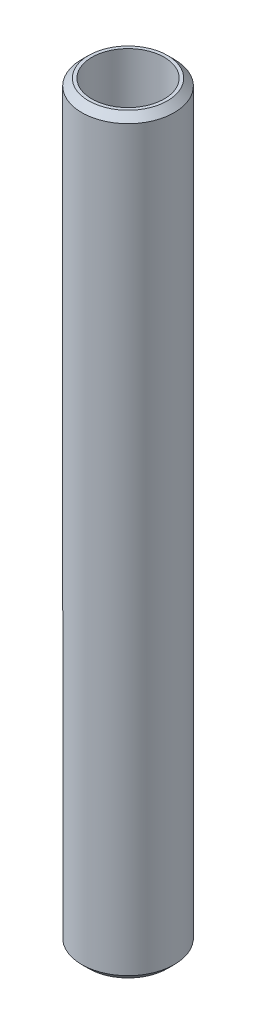
ISO-10303-21;
HEADER;
FILE_DESCRIPTION(('STEP AP214'),'2;1');
FILE_NAME('part.step','',(''),(''),'','','');
FILE_SCHEMA(('AUTOMOTIVE_DESIGN { 1 0 10303 214 1 1 1 1 }'));
ENDSEC;
DATA;
#1=APPLICATION_CONTEXT('core data for automotive mechanical design processes');
#2=APPLICATION_PROTOCOL_DEFINITION('international standard','automotive_design',2000,#1);
#3=PRODUCT_CONTEXT('',#1,'mechanical');
#4=PRODUCT('Part','Part','',(#3));
#5=PRODUCT_RELATED_PRODUCT_CATEGORY('part','',(#4));
#6=PRODUCT_DEFINITION_FORMATION('','',#4);
#7=PRODUCT_DEFINITION_CONTEXT('part definition',#1,'design');
#8=PRODUCT_DEFINITION('design','',#6,#7);
#9=PRODUCT_DEFINITION_SHAPE('','',#8);
#10=(LENGTH_UNIT() NAMED_UNIT(*) SI_UNIT(.MILLI.,.METRE.));
#11=(NAMED_UNIT(*) PLANE_ANGLE_UNIT() SI_UNIT($,.RADIAN.));
#12=(NAMED_UNIT(*) SI_UNIT($,.STERADIAN.) SOLID_ANGLE_UNIT());
#13=UNCERTAINTY_MEASURE_WITH_UNIT(LENGTH_MEASURE(1.E-05),#10,'distance_accuracy_value','');
#14=(GEOMETRIC_REPRESENTATION_CONTEXT(3) GLOBAL_UNCERTAINTY_ASSIGNED_CONTEXT((#13)) GLOBAL_UNIT_ASSIGNED_CONTEXT((#10,
#11,#12)) REPRESENTATION_CONTEXT('',''));
#15=CARTESIAN_POINT('',(0.,0.,0.));
#16=DIRECTION('',(0.,0.,1.));
#17=DIRECTION('',(1.,0.,0.));
#18=AXIS2_PLACEMENT_3D('',#15,#16,#17);
#19=CARTESIAN_POINT('',(0.,365.881459210702,0.));
#20=DIRECTION('',(0.,-1.,0.));
#21=DIRECTION('',(0.,0.,-1.));
#22=AXIS2_PLACEMENT_3D('',#19,#20,#21);
#23=CYLINDRICAL_SURFACE('',#22,22.5);
#24=CARTESIAN_POINT('',(0.,362.557926224536,0.));
#25=DIRECTION('',(0.,1.,0.));
#26=DIRECTION('',(0.,0.,1.));
#27=AXIS2_PLACEMENT_3D('',#24,#25,#26);
#28=CIRCLE('',#27,22.5);
#29=CARTESIAN_POINT('',(0.,362.557926224536,-22.5));
#30=VERTEX_POINT('',#29);
#31=EDGE_CURVE('E50',#30,#30,#28,.F.);
#32=CARTESIAN_POINT('',(0.,3.32353298616633,0.));
#33=DIRECTION('',(0.,1.,0.));
#34=DIRECTION('',(0.,0.,1.));
#35=AXIS2_PLACEMENT_3D('',#32,#33,#34);
#36=CIRCLE('',#35,22.5);
#37=CARTESIAN_POINT('',(0.,3.32353298616633,-22.5));
#38=VERTEX_POINT('',#37);
#39=EDGE_CURVE('E51',#38,#38,#36,.T.);
#40=CARTESIAN_POINT('',(0.,362.557926224536,-22.5));
#41=CARTESIAN_POINT('',(0.,358.81590129497,-22.5));
#42=CARTESIAN_POINT('',(0.,355.073876365403,-22.5));
#43=CARTESIAN_POINT('',(0.,347.589826506271,-22.5));
#44=CARTESIAN_POINT('',(0.,343.847801576704,-22.5));
#45=CARTESIAN_POINT('',(0.,336.363751717572,-22.5));
#46=CARTESIAN_POINT('',(0.,332.621726788005,-22.5));
#47=CARTESIAN_POINT('',(0.,325.137676928873,-22.5));
#48=CARTESIAN_POINT('',(0.,321.395651999306,-22.5));
#49=CARTESIAN_POINT('',(0.,313.911602140173,-22.5));
#50=CARTESIAN_POINT('',(0.,310.169577210607,-22.5));
#51=CARTESIAN_POINT('',(0.,302.685527351474,-22.5));
#52=CARTESIAN_POINT('',(0.,298.943502421908,-22.5));
#53=CARTESIAN_POINT('',(0.,291.459452562775,-22.5));
#54=CARTESIAN_POINT('',(0.,287.717427633209,-22.5));
#55=CARTESIAN_POINT('',(0.,280.233377774076,-22.5));
#56=CARTESIAN_POINT('',(0.,276.49135284451,-22.5));
#57=CARTESIAN_POINT('',(0.,269.007302985377,-22.5));
#58=CARTESIAN_POINT('',(0.,265.265278055811,-22.5));
#59=CARTESIAN_POINT('',(0.,257.781228196678,-22.5));
#60=CARTESIAN_POINT('',(0.,254.039203267112,-22.5));
#61=CARTESIAN_POINT('',(0.,246.555153407979,-22.5));
#62=CARTESIAN_POINT('',(0.,242.813128478413,-22.5));
#63=CARTESIAN_POINT('',(0.,235.32907861928,-22.5));
#64=CARTESIAN_POINT('',(0.,231.587053689714,-22.5));
#65=CARTESIAN_POINT('',(0.,224.103003830581,-22.5));
#66=CARTESIAN_POINT('',(0.,220.360978901015,-22.5));
#67=CARTESIAN_POINT('',(0.,212.876929041882,-22.5));
#68=CARTESIAN_POINT('',(0.,209.134904112316,-22.5));
#69=CARTESIAN_POINT('',(0.,201.650854253183,-22.5));
#70=CARTESIAN_POINT('',(0.,197.908829323617,-22.5));
#71=CARTESIAN_POINT('',(0.,190.424779464484,-22.5));
#72=CARTESIAN_POINT('',(0.,186.682754534918,-22.5));
#73=CARTESIAN_POINT('',(0.,179.198704675785,-22.5));
#74=CARTESIAN_POINT('',(0.,175.456679746218,-22.5));
#75=CARTESIAN_POINT('',(0.,167.972629887086,-22.5));
#76=CARTESIAN_POINT('',(0.,164.230604957519,-22.5));
#77=CARTESIAN_POINT('',(0.,156.746555098387,-22.5));
#78=CARTESIAN_POINT('',(0.,153.00453016882,-22.5));
#79=CARTESIAN_POINT('',(0.,145.520480309688,-22.5));
#80=CARTESIAN_POINT('',(0.,141.778455380121,-22.5));
#81=CARTESIAN_POINT('',(0.,134.294405520989,-22.5));
#82=CARTESIAN_POINT('',(0.,130.552380591422,-22.5));
#83=CARTESIAN_POINT('',(0.,123.06833073229,-22.5));
#84=CARTESIAN_POINT('',(0.,119.326305802723,-22.5));
#85=CARTESIAN_POINT('',(0.,111.842255943591,-22.5));
#86=CARTESIAN_POINT('',(0.,108.100231014024,-22.5));
#87=CARTESIAN_POINT('',(0.,100.616181154891,-22.5));
#88=CARTESIAN_POINT('',(0.,96.8741562253251,-22.5));
#89=CARTESIAN_POINT('',(0.,89.3901063661924,-22.5));
#90=CARTESIAN_POINT('',(0.,85.648081436626,-22.5));
#91=CARTESIAN_POINT('',(0.,78.1640315774933,-22.5));
#92=CARTESIAN_POINT('',(0.,74.422006647927,-22.5));
#93=CARTESIAN_POINT('',(0.,66.9379567887943,-22.5));
#94=CARTESIAN_POINT('',(0.,63.195931859228,-22.5));
#95=CARTESIAN_POINT('',(0.,55.7118820000953,-22.5));
#96=CARTESIAN_POINT('',(0.,51.9698570705289,-22.5));
#97=CARTESIAN_POINT('',(0.,44.4858072113962,-22.5));
#98=CARTESIAN_POINT('',(0.,40.7437822818298,-22.5));
#99=CARTESIAN_POINT('',(0.,33.2597324226971,-22.5));
#100=CARTESIAN_POINT('',(0.,29.5177074931308,-22.5));
#101=CARTESIAN_POINT('',(0.,22.0336576339981,-22.5));
#102=CARTESIAN_POINT('',(0.,18.2916327044318,-22.5));
#103=CARTESIAN_POINT('',(0.,10.8075828452991,-22.5));
#104=CARTESIAN_POINT('',(0.,7.06555791573269,-22.5));
#105=CARTESIAN_POINT('',(0.,3.32353298616633,-22.5));
#106=B_SPLINE_CURVE_WITH_KNOTS('',3,(#40,#41,#42,#43,#44,#45,#46,#47,#48,#49,#50,#51,#52,#53,
#54,#55,#56,#57,#58,#59,#60,#61,#62,#63,#64,#65,#66,#67,#68,#69,#70,#71,#72,#73,#74,#75,#76,#77,
#78,#79,#80,#81,#82,#83,#84,#85,#86,#87,#88,#89,#90,#91,#92,#93,#94,#95,#96,#97,#98,#99,#100,
#101,#102,#103,#104,#105),.UNSPECIFIED.,.F.,.F.,(4,2,2,2,2,2,2,2,2,2,2,2,2,2,2,2,2,2,2,2,2,2,2,
2,2,2,2,2,2,2,2,2,4),(0.,11.2260747886991,22.4521495773981,33.6782243660972,44.9042991547962,
56.1303739434953,67.3564487321943,78.5825235208934,89.8085983095924,101.034673098292,
112.260747886991,123.48682267569,134.712897464389,145.938972253088,157.165047041787,
168.391121830486,179.617196619185,190.843271407884,202.069346196583,213.295420985282,
224.521495773981,235.74757056268,246.973645351379,258.199720140078,269.425794928777,
280.651869717476,291.877944506175,303.104019294874,314.330094083573,325.556168872273,
336.782243660972,348.008318449671,359.23439323837),.UNSPECIFIED.);
#107=EDGE_CURVE('BSEAM39',#30,#38,#106,.T.);
#108=ORIENTED_EDGE('',*,*,#31,.T.);
#109=ORIENTED_EDGE('',*,*,#39,.T.);
#110=ORIENTED_EDGE('',*,*,#107,.T.);
#111=ORIENTED_EDGE('',*,*,#107,.F.);
#112=EDGE_LOOP('',(#108,#110,#109,#111));
#113=FACE_BOUND('',#112,.T.);
#114=ADVANCED_FACE('F39',(#113),#23,.T.);
#115=CARTESIAN_POINT('',(0.,365.881459210702,0.));
#116=DIRECTION('',(0.,1.,0.));
#117=DIRECTION('',(0.,0.,1.));
#118=AXIS2_PLACEMENT_3D('',#115,#116,#117);
#119=PLANE('',#118);
#120=CARTESIAN_POINT('',(0.,365.881459210702,0.));
#121=DIRECTION('',(0.,1.,0.));
#122=DIRECTION('',(0.,0.,1.));
#123=AXIS2_PLACEMENT_3D('',#120,#121,#122);
#124=CIRCLE('',#123,19.176467013834);
#125=CARTESIAN_POINT('',(0.,365.881459210702,19.176467013834));
#126=VERTEX_POINT('',#125);
#127=EDGE_CURVE('E54',#126,#126,#124,.T.);
#128=ORIENTED_EDGE('',*,*,#127,.T.);
#129=EDGE_LOOP('',(#128));
#130=FACE_BOUND('',#129,.T.);
#131=CARTESIAN_POINT('',(0.,365.881459210702,0.));
#132=DIRECTION('',(0.,1.,0.));
#133=DIRECTION('',(0.,0.,1.));
#134=AXIS2_PLACEMENT_3D('',#131,#132,#133);
#135=CIRCLE('',#134,17.6108934483264);
#136=CARTESIAN_POINT('',(0.,365.881459210702,-17.6108934483264));
#137=VERTEX_POINT('',#136);
#138=EDGE_CURVE('E58',#137,#137,#135,.T.);
#139=ORIENTED_EDGE('',*,*,#138,.F.);
#140=EDGE_LOOP('',(#139));
#141=FACE_BOUND('',#140,.T.);
#142=ADVANCED_FACE('F69',(#130,#141),#119,.T.);
#143=CARTESIAN_POINT('',(0.,0.,0.));
#144=DIRECTION('',(0.,1.,0.));
#145=DIRECTION('',(0.,0.,1.));
#146=AXIS2_PLACEMENT_3D('',#143,#144,#145);
#147=PLANE('',#146);
#148=CARTESIAN_POINT('',(0.,0.,0.));
#149=DIRECTION('',(0.,1.,0.));
#150=DIRECTION('',(0.,0.,1.));
#151=AXIS2_PLACEMENT_3D('',#148,#149,#150);
#152=CIRCLE('',#151,19.1764670138336);
#153=CARTESIAN_POINT('',(0.,0.,19.1764670138336));
#154=VERTEX_POINT('',#153);
#155=EDGE_CURVE('E10',#154,#154,#152,.F.);
#156=ORIENTED_EDGE('',*,*,#155,.T.);
#157=EDGE_LOOP('',(#156));
#158=FACE_BOUND('',#157,.T.);
#159=CARTESIAN_POINT('',(0.,0.,0.));
#160=DIRECTION('',(0.,1.,0.));
#161=DIRECTION('',(0.,0.,1.));
#162=AXIS2_PLACEMENT_3D('',#159,#160,#161);
#163=CIRCLE('',#162,17.6108934483264);
#164=CARTESIAN_POINT('',(0.,0.,-17.6108934483264));
#165=VERTEX_POINT('',#164);
#166=EDGE_CURVE('E63',#165,#165,#163,.T.);
#167=ORIENTED_EDGE('',*,*,#166,.T.);
#168=EDGE_LOOP('',(#167));
#169=FACE_BOUND('',#168,.T.);
#170=ADVANCED_FACE('F75',(#158,#169),#147,.F.);
#171=CARTESIAN_POINT('',(0.,365.881459210702,0.));
#172=DIRECTION('',(0.,-1.,0.));
#173=DIRECTION('',(0.,0.,-1.));
#174=AXIS2_PLACEMENT_3D('',#171,#172,#173);
#175=CYLINDRICAL_SURFACE('',#174,17.6108934483264);
#176=CARTESIAN_POINT('',(0.,365.881459210702,-17.6108934483264));
#177=CARTESIAN_POINT('',(0.,362.070194010591,-17.6108934483264));
#178=CARTESIAN_POINT('',(0.,358.258928810479,-17.6108934483264));
#179=CARTESIAN_POINT('',(0.,350.636398410256,-17.6108934483264));
#180=CARTESIAN_POINT('',(0.,346.825133210145,-17.6108934483264));
#181=CARTESIAN_POINT('',(0.,339.202602809922,-17.6108934483264));
#182=CARTESIAN_POINT('',(0.,335.39133760981,-17.6108934483264));
#183=CARTESIAN_POINT('',(0.,327.768807209587,-17.6108934483264));
#184=CARTESIAN_POINT('',(0.,323.957542009476,-17.6108934483264));
#185=CARTESIAN_POINT('',(0.,316.335011609253,-17.6108934483264));
#186=CARTESIAN_POINT('',(0.,312.523746409141,-17.6108934483264));
#187=CARTESIAN_POINT('',(0.,304.901216008918,-17.6108934483264));
#188=CARTESIAN_POINT('',(0.,301.089950808807,-17.6108934483264));
#189=CARTESIAN_POINT('',(0.,293.467420408584,-17.6108934483264));
#190=CARTESIAN_POINT('',(0.,289.656155208472,-17.6108934483264));
#191=CARTESIAN_POINT('',(0.,282.033624808249,-17.6108934483264));
#192=CARTESIAN_POINT('',(0.,278.222359608138,-17.6108934483264));
#193=CARTESIAN_POINT('',(0.,270.599829207915,-17.6108934483264));
#194=CARTESIAN_POINT('',(0.,266.788564007804,-17.6108934483264));
#195=CARTESIAN_POINT('',(0.,259.166033607581,-17.6108934483264));
#196=CARTESIAN_POINT('',(0.,255.354768407469,-17.6108934483264));
#197=CARTESIAN_POINT('',(0.,247.732238007246,-17.6108934483264));
#198=CARTESIAN_POINT('',(0.,243.920972807135,-17.6108934483264));
#199=CARTESIAN_POINT('',(0.,236.298442406912,-17.6108934483264));
#200=CARTESIAN_POINT('',(0.,232.4871772068,-17.6108934483264));
#201=CARTESIAN_POINT('',(0.,224.864646806577,-17.6108934483264));
#202=CARTESIAN_POINT('',(0.,221.053381606466,-17.6108934483264));
#203=CARTESIAN_POINT('',(0.,213.430851206243,-17.6108934483264));
#204=CARTESIAN_POINT('',(0.,209.619586006131,-17.6108934483264));
#205=CARTESIAN_POINT('',(0.,201.997055605908,-17.6108934483264));
#206=CARTESIAN_POINT('',(0.,198.185790405797,-17.6108934483264));
#207=CARTESIAN_POINT('',(0.,190.563260005574,-17.6108934483264));
#208=CARTESIAN_POINT('',(0.,186.751994805462,-17.6108934483264));
#209=CARTESIAN_POINT('',(0.,179.129464405239,-17.6108934483264));
#210=CARTESIAN_POINT('',(0.,175.318199205128,-17.6108934483264));
#211=CARTESIAN_POINT('',(0.,167.695668804905,-17.6108934483264));
#212=CARTESIAN_POINT('',(0.,163.884403604794,-17.6108934483264));
#213=CARTESIAN_POINT('',(0.,156.261873204571,-17.6108934483264));
#214=CARTESIAN_POINT('',(0.,152.450608004459,-17.6108934483264));
#215=CARTESIAN_POINT('',(0.,144.828077604236,-17.6108934483264));
#216=CARTESIAN_POINT('',(0.,141.016812404125,-17.6108934483264));
#217=CARTESIAN_POINT('',(0.,133.394282003902,-17.6108934483264));
#218=CARTESIAN_POINT('',(0.,129.58301680379,-17.6108934483264));
#219=CARTESIAN_POINT('',(0.,121.960486403567,-17.6108934483264));
#220=CARTESIAN_POINT('',(0.,118.149221203456,-17.6108934483264));
#221=CARTESIAN_POINT('',(0.,110.526690803233,-17.6108934483264));
#222=CARTESIAN_POINT('',(0.,106.715425603121,-17.6108934483264));
#223=CARTESIAN_POINT('',(0.,99.0928952028984,-17.6108934483264));
#224=CARTESIAN_POINT('',(0.,95.281630002787,-17.6108934483264));
#225=CARTESIAN_POINT('',(0.,87.659099602564,-17.6108934483264));
#226=CARTESIAN_POINT('',(0.,83.8478344024525,-17.6108934483264));
#227=CARTESIAN_POINT('',(0.,76.2253040022296,-17.6108934483264));
#228=CARTESIAN_POINT('',(0.,72.4140388021181,-17.6108934483264));
#229=CARTESIAN_POINT('',(0.,64.7915084018951,-17.6108934483264));
#230=CARTESIAN_POINT('',(0.,60.9802432017836,-17.6108934483264));
#231=CARTESIAN_POINT('',(0.,53.3577128015607,-17.6108934483264));
#232=CARTESIAN_POINT('',(0.,49.5464476014492,-17.6108934483264));
#233=CARTESIAN_POINT('',(0.,41.9239172012262,-17.6108934483264));
#234=CARTESIAN_POINT('',(0.,38.1126520011147,-17.6108934483264));
#235=CARTESIAN_POINT('',(0.,30.4901216008918,-17.6108934483264));
#236=CARTESIAN_POINT('',(0.,26.6788564007803,-17.6108934483264));
#237=CARTESIAN_POINT('',(0.,19.0563260005573,-17.6108934483264));
#238=CARTESIAN_POINT('',(0.,15.2450608004459,-17.6108934483264));
#239=CARTESIAN_POINT('',(0.,7.62253040022289,-17.6108934483264));
#240=CARTESIAN_POINT('',(0.,3.81126520011142,-17.6108934483264));
#241=CARTESIAN_POINT('',(0.,0.,-17.6108934483264));
#242=B_SPLINE_CURVE_WITH_KNOTS('',3,(#176,#177,#178,#179,#180,#181,#182,#183,#184,#185,#186,
#187,#188,#189,#190,#191,#192,#193,#194,#195,#196,#197,#198,#199,#200,#201,#202,#203,#204,#205,
#206,#207,#208,#209,#210,#211,#212,#213,#214,#215,#216,#217,#218,#219,#220,#221,#222,#223,#224,
#225,#226,#227,#228,#229,#230,#231,#232,#233,#234,#235,#236,#237,#238,#239,#240,#241),
.UNSPECIFIED.,.F.,.F.,(4,2,2,2,2,2,2,2,2,2,2,2,2,2,2,2,2,2,2,2,2,2,2,2,2,2,2,2,2,2,2,2,4),(0.,
11.4337956003345,22.8675912006689,34.3013868010034,45.7351824013378,57.1689780016723,
68.6027736020067,80.0365692023411,91.4703648026756,102.90416040301,114.337956003344,
125.771751603679,137.205547204013,148.639342804348,160.073138404682,171.506934005017,
182.940729605351,194.374525205686,205.80832080602,217.242116406354,228.675912006689,
240.109707607023,251.543503207358,262.977298807692,274.411094408027,285.844890008361,
297.278685608695,308.71248120903,320.146276809364,331.580072409699,343.013868010033,
354.447663610368,365.881459210702),.UNSPECIFIED.);
#243=EDGE_CURVE('BSEAM70',#137,#165,#242,.T.);
#244=ORIENTED_EDGE('',*,*,#138,.T.);
#245=ORIENTED_EDGE('',*,*,#166,.F.);
#246=ORIENTED_EDGE('',*,*,#243,.T.);
#247=ORIENTED_EDGE('',*,*,#243,.F.);
#248=EDGE_LOOP('',(#244,#246,#245,#247));
#249=FACE_BOUND('',#248,.T.);
#250=ADVANCED_FACE('F70',(#249),#175,.F.);
#251=CARTESIAN_POINT('',(0.,365.881459210702,0.));
#252=DIRECTION('',(0.,-1.,0.));
#253=DIRECTION('',(0.,0.,-1.));
#254=AXIS2_PLACEMENT_3D('',#251,#252,#253);
#255=CONICAL_SURFACE('',#254,19.176467013834,0.785398163397446);
#256=ORIENTED_EDGE('',*,*,#31,.F.);
#257=EDGE_LOOP('',(#256));
#258=FACE_BOUND('',#257,.T.);
#259=ORIENTED_EDGE('',*,*,#127,.F.);
#260=EDGE_LOOP('',(#259));
#261=FACE_BOUND('',#260,.T.);
#262=ADVANCED_FACE('F81',(#258,#261),#255,.T.);
#263=CARTESIAN_POINT('',(0.,3.32353298616633,0.));
#264=DIRECTION('',(0.,1.,0.));
#265=DIRECTION('',(0.,0.,1.));
#266=AXIS2_PLACEMENT_3D('',#263,#264,#265);
#267=CONICAL_SURFACE('',#266,22.5,0.785398163397455);
#268=ORIENTED_EDGE('',*,*,#155,.F.);
#269=EDGE_LOOP('',(#268));
#270=FACE_BOUND('',#269,.T.);
#271=ORIENTED_EDGE('',*,*,#39,.F.);
#272=EDGE_LOOP('',(#271));
#273=FACE_BOUND('',#272,.T.);
#274=ADVANCED_FACE('F45',(#270,#273),#267,.T.);
#275=CLOSED_SHELL('',(#114,#142,#170,#250,#262,#274));
#276=MANIFOLD_SOLID_BREP('B2',#275);
#277=ADVANCED_BREP_SHAPE_REPRESENTATION('',(#18,#276),#14);
#278=SHAPE_DEFINITION_REPRESENTATION(#9,#277);
ENDSEC;
END-ISO-10303-21;
